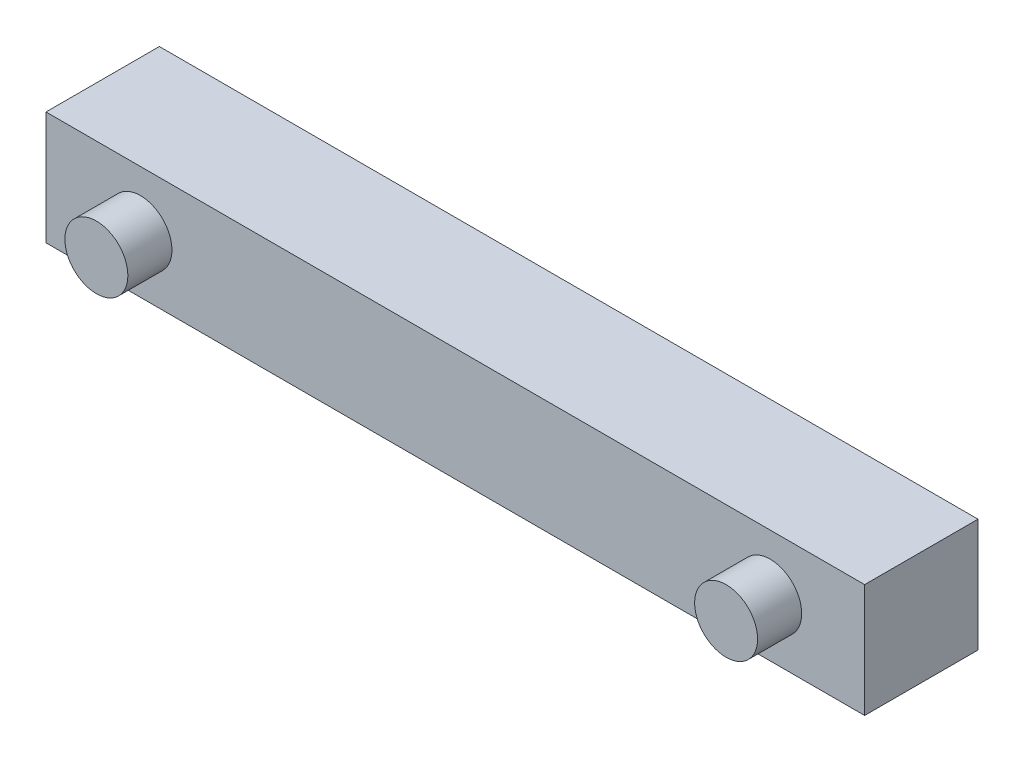
ISO-10303-21;
HEADER;
FILE_DESCRIPTION(('STEP AP214'),'2;1');
FILE_NAME('part.step','',(''),(''),'','','');
FILE_SCHEMA(('AUTOMOTIVE_DESIGN { 1 0 10303 214 1 1 1 1 }'));
ENDSEC;
DATA;
#1=APPLICATION_CONTEXT('core data for automotive mechanical design processes');
#2=APPLICATION_PROTOCOL_DEFINITION('international standard','automotive_design',2000,#1);
#3=PRODUCT_CONTEXT('',#1,'mechanical');
#4=PRODUCT('Part','Part','',(#3));
#5=PRODUCT_RELATED_PRODUCT_CATEGORY('part','',(#4));
#6=PRODUCT_DEFINITION_FORMATION('','',#4);
#7=PRODUCT_DEFINITION_CONTEXT('part definition',#1,'design');
#8=PRODUCT_DEFINITION('design','',#6,#7);
#9=PRODUCT_DEFINITION_SHAPE('','',#8);
#10=(LENGTH_UNIT() NAMED_UNIT(*) SI_UNIT(.MILLI.,.METRE.));
#11=(NAMED_UNIT(*) PLANE_ANGLE_UNIT() SI_UNIT($,.RADIAN.));
#12=(NAMED_UNIT(*) SI_UNIT($,.STERADIAN.) SOLID_ANGLE_UNIT());
#13=UNCERTAINTY_MEASURE_WITH_UNIT(LENGTH_MEASURE(1.E-05),#10,'distance_accuracy_value','');
#14=(GEOMETRIC_REPRESENTATION_CONTEXT(3) GLOBAL_UNCERTAINTY_ASSIGNED_CONTEXT((#13)) GLOBAL_UNIT_ASSIGNED_CONTEXT((#10,
#11,#12)) REPRESENTATION_CONTEXT('',''));
#15=CARTESIAN_POINT('',(0.,0.,0.));
#16=DIRECTION('',(0.,0.,1.));
#17=DIRECTION('',(1.,0.,0.));
#18=AXIS2_PLACEMENT_3D('',#15,#16,#17);
#19=CARTESIAN_POINT('',(0.,0.,9.));
#20=DIRECTION('',(0.,0.,-1.));
#21=DIRECTION('',(-1.,0.,0.));
#22=AXIS2_PLACEMENT_3D('',#19,#20,#21);
#23=PLANE('',#22);
#24=CARTESIAN_POINT('',(7.5,4.5,9.));
#25=DIRECTION('',(0.,0.,-1.));
#26=DIRECTION('',(-1.,0.,0.));
#27=AXIS2_PLACEMENT_3D('',#24,#25,#26);
#28=CIRCLE('',#27,2.5);
#29=CARTESIAN_POINT('',(5.,4.5,9.));
#30=VERTEX_POINT('',#29);
#31=EDGE_CURVE('E42',#30,#30,#28,.F.);
#32=ORIENTED_EDGE('',*,*,#31,.F.);
#33=EDGE_LOOP('',(#32));
#34=FACE_BOUND('',#33,.T.);
#35=DIRECTION('',(0.,-1.,0.));
#36=VECTOR('',#35,1.);
#37=CARTESIAN_POINT('',(0.,0.,9.));
#38=LINE('',#37,#36);
#39=CARTESIAN_POINT('',(0.,9.,9.));
#40=VERTEX_POINT('',#39);
#41=CARTESIAN_POINT('',(0.,0.,9.));
#42=VERTEX_POINT('',#41);
#43=EDGE_CURVE('E86',#40,#42,#38,.T.);
#44=ORIENTED_EDGE('',*,*,#43,.T.);
#45=DIRECTION('',(1.,0.,0.));
#46=VECTOR('',#45,1.);
#47=CARTESIAN_POINT('',(0.,0.,9.));
#48=LINE('',#47,#46);
#49=CARTESIAN_POINT('',(65.,0.,9.));
#50=VERTEX_POINT('',#49);
#51=EDGE_CURVE('E81',#42,#50,#48,.T.);
#52=ORIENTED_EDGE('',*,*,#51,.T.);
#53=DIRECTION('',(0.,1.,0.));
#54=VECTOR('',#53,1.);
#55=CARTESIAN_POINT('',(65.,0.,9.));
#56=LINE('',#55,#54);
#57=CARTESIAN_POINT('',(65.,9.,9.));
#58=VERTEX_POINT('',#57);
#59=EDGE_CURVE('E84',#50,#58,#56,.T.);
#60=ORIENTED_EDGE('',*,*,#59,.T.);
#61=DIRECTION('',(-1.,0.,0.));
#62=VECTOR('',#61,1.);
#63=CARTESIAN_POINT('',(0.,9.,9.));
#64=LINE('',#63,#62);
#65=EDGE_CURVE('E50',#58,#40,#64,.T.);
#66=ORIENTED_EDGE('',*,*,#65,.T.);
#67=EDGE_LOOP('',(#44,#52,#60,#66));
#68=FACE_BOUND('',#67,.T.);
#69=CARTESIAN_POINT('',(57.5,4.5,9.));
#70=DIRECTION('',(0.,0.,-1.));
#71=DIRECTION('',(-1.,0.,0.));
#72=AXIS2_PLACEMENT_3D('',#69,#70,#71);
#73=CIRCLE('',#72,2.5);
#74=CARTESIAN_POINT('',(55.,4.5,9.));
#75=VERTEX_POINT('',#74);
#76=EDGE_CURVE('E11',#75,#75,#73,.F.);
#77=ORIENTED_EDGE('',*,*,#76,.F.);
#78=EDGE_LOOP('',(#77));
#79=FACE_BOUND('',#78,.T.);
#80=ADVANCED_FACE('F33',(#34,#68,#79),#23,.F.);
#81=CARTESIAN_POINT('',(0.,0.,9.));
#82=DIRECTION('',(1.,0.,0.));
#83=DIRECTION('',(0.,0.,-1.));
#84=AXIS2_PLACEMENT_3D('',#81,#82,#83);
#85=PLANE('',#84);
#86=DIRECTION('',(0.,-1.,0.));
#87=VECTOR('',#86,1.);
#88=CARTESIAN_POINT('',(0.,0.,0.));
#89=LINE('',#88,#87);
#90=CARTESIAN_POINT('',(0.,9.,0.));
#91=VERTEX_POINT('',#90);
#92=CARTESIAN_POINT('',(0.,0.,0.));
#93=VERTEX_POINT('',#92);
#94=EDGE_CURVE('E101',#91,#93,#89,.T.);
#95=ORIENTED_EDGE('',*,*,#94,.T.);
#96=DIRECTION('',(0.,0.,-1.));
#97=VECTOR('',#96,1.);
#98=CARTESIAN_POINT('',(0.,0.,9.));
#99=LINE('',#98,#97);
#100=EDGE_CURVE('E92',#42,#93,#99,.T.);
#101=ORIENTED_EDGE('',*,*,#100,.F.);
#102=ORIENTED_EDGE('',*,*,#43,.F.);
#103=DIRECTION('',(0.,0.,-1.));
#104=VECTOR('',#103,1.);
#105=CARTESIAN_POINT('',(0.,9.,9.));
#106=LINE('',#105,#104);
#107=EDGE_CURVE('E97',#40,#91,#106,.T.);
#108=ORIENTED_EDGE('',*,*,#107,.T.);
#109=EDGE_LOOP('',(#95,#101,#102,#108));
#110=FACE_BOUND('',#109,.T.);
#111=ADVANCED_FACE('F35',(#110),#85,.F.);
#112=CARTESIAN_POINT('',(0.,0.,9.));
#113=DIRECTION('',(0.,1.,0.));
#114=DIRECTION('',(0.,0.,1.));
#115=AXIS2_PLACEMENT_3D('',#112,#113,#114);
#116=PLANE('',#115);
#117=DIRECTION('',(1.,0.,0.));
#118=VECTOR('',#117,1.);
#119=CARTESIAN_POINT('',(0.,0.,0.));
#120=LINE('',#119,#118);
#121=CARTESIAN_POINT('',(65.,0.,0.));
#122=VERTEX_POINT('',#121);
#123=EDGE_CURVE('E91',#93,#122,#120,.T.);
#124=ORIENTED_EDGE('',*,*,#123,.T.);
#125=DIRECTION('',(0.,0.,-1.));
#126=VECTOR('',#125,1.);
#127=CARTESIAN_POINT('',(65.,0.,9.));
#128=LINE('',#127,#126);
#129=EDGE_CURVE('E89',#50,#122,#128,.T.);
#130=ORIENTED_EDGE('',*,*,#129,.F.);
#131=ORIENTED_EDGE('',*,*,#51,.F.);
#132=ORIENTED_EDGE('',*,*,#100,.T.);
#133=EDGE_LOOP('',(#124,#130,#131,#132));
#134=FACE_BOUND('',#133,.T.);
#135=ADVANCED_FACE('F90',(#134),#116,.F.);
#136=CARTESIAN_POINT('',(65.,0.,9.));
#137=DIRECTION('',(-1.,0.,0.));
#138=DIRECTION('',(0.,0.,1.));
#139=AXIS2_PLACEMENT_3D('',#136,#137,#138);
#140=PLANE('',#139);
#141=DIRECTION('',(0.,1.,0.));
#142=VECTOR('',#141,1.);
#143=CARTESIAN_POINT('',(65.,0.,0.));
#144=LINE('',#143,#142);
#145=CARTESIAN_POINT('',(65.,9.,0.));
#146=VERTEX_POINT('',#145);
#147=EDGE_CURVE('E67',#122,#146,#144,.T.);
#148=ORIENTED_EDGE('',*,*,#147,.T.);
#149=DIRECTION('',(0.,0.,-1.));
#150=VECTOR('',#149,1.);
#151=CARTESIAN_POINT('',(65.,9.,9.));
#152=LINE('',#151,#150);
#153=EDGE_CURVE('E93',#58,#146,#152,.T.);
#154=ORIENTED_EDGE('',*,*,#153,.F.);
#155=ORIENTED_EDGE('',*,*,#59,.F.);
#156=ORIENTED_EDGE('',*,*,#129,.T.);
#157=EDGE_LOOP('',(#148,#154,#155,#156));
#158=FACE_BOUND('',#157,.T.);
#159=ADVANCED_FACE('F95',(#158),#140,.F.);
#160=CARTESIAN_POINT('',(0.,9.,9.));
#161=DIRECTION('',(0.,-1.,0.));
#162=DIRECTION('',(0.,0.,-1.));
#163=AXIS2_PLACEMENT_3D('',#160,#161,#162);
#164=PLANE('',#163);
#165=DIRECTION('',(-1.,0.,0.));
#166=VECTOR('',#165,1.);
#167=CARTESIAN_POINT('',(0.,9.,0.));
#168=LINE('',#167,#166);
#169=EDGE_CURVE('E73',#146,#91,#168,.T.);
#170=ORIENTED_EDGE('',*,*,#169,.T.);
#171=ORIENTED_EDGE('',*,*,#107,.F.);
#172=ORIENTED_EDGE('',*,*,#65,.F.);
#173=ORIENTED_EDGE('',*,*,#153,.T.);
#174=EDGE_LOOP('',(#170,#171,#172,#173));
#175=FACE_BOUND('',#174,.T.);
#176=ADVANCED_FACE('F127',(#175),#164,.F.);
#177=CARTESIAN_POINT('',(0.,0.,0.));
#178=DIRECTION('',(0.,0.,-1.));
#179=DIRECTION('',(-1.,0.,0.));
#180=AXIS2_PLACEMENT_3D('',#177,#178,#179);
#181=PLANE('',#180);
#182=ORIENTED_EDGE('',*,*,#94,.F.);
#183=ORIENTED_EDGE('',*,*,#169,.F.);
#184=ORIENTED_EDGE('',*,*,#147,.F.);
#185=ORIENTED_EDGE('',*,*,#123,.F.);
#186=EDGE_LOOP('',(#182,#183,#184,#185));
#187=FACE_BOUND('',#186,.T.);
#188=ADVANCED_FACE('F124',(#187),#181,.T.);
#189=CARTESIAN_POINT('',(7.5,4.5,12.5));
#190=DIRECTION('',(0.,0.,-1.));
#191=DIRECTION('',(-1.,0.,0.));
#192=AXIS2_PLACEMENT_3D('',#189,#190,#191);
#193=CYLINDRICAL_SURFACE('',#192,2.5);
#194=CARTESIAN_POINT('',(7.5,4.5,12.5));
#195=DIRECTION('',(0.,0.,1.));
#196=DIRECTION('',(1.,0.,0.));
#197=AXIS2_PLACEMENT_3D('',#194,#195,#196);
#198=CIRCLE('',#197,2.5);
#199=CARTESIAN_POINT('',(10.,4.5,12.5));
#200=VERTEX_POINT('',#199);
#201=EDGE_CURVE('E104',#200,#200,#198,.T.);
#202=ORIENTED_EDGE('',*,*,#201,.F.);
#203=EDGE_LOOP('',(#202));
#204=FACE_BOUND('',#203,.T.);
#205=ORIENTED_EDGE('',*,*,#31,.T.);
#206=EDGE_LOOP('',(#205));
#207=FACE_BOUND('',#206,.T.);
#208=ADVANCED_FACE('F113',(#204,#207),#193,.T.);
#209=CARTESIAN_POINT('',(7.5,4.5,12.5));
#210=DIRECTION('',(0.,0.,1.));
#211=DIRECTION('',(1.,0.,0.));
#212=AXIS2_PLACEMENT_3D('',#209,#210,#211);
#213=PLANE('',#212);
#214=ORIENTED_EDGE('',*,*,#201,.T.);
#215=EDGE_LOOP('',(#214));
#216=FACE_BOUND('',#215,.T.);
#217=ADVANCED_FACE('F155',(#216),#213,.T.);
#218=CARTESIAN_POINT('',(57.5,4.5,12.5));
#219=DIRECTION('',(0.,0.,-1.));
#220=DIRECTION('',(-1.,0.,0.));
#221=AXIS2_PLACEMENT_3D('',#218,#219,#220);
#222=CYLINDRICAL_SURFACE('',#221,2.5);
#223=CARTESIAN_POINT('',(57.5,4.5,12.5));
#224=DIRECTION('',(0.,0.,1.));
#225=DIRECTION('',(1.,0.,0.));
#226=AXIS2_PLACEMENT_3D('',#223,#224,#225);
#227=CIRCLE('',#226,2.5);
#228=CARTESIAN_POINT('',(60.,4.5,12.5));
#229=VERTEX_POINT('',#228);
#230=EDGE_CURVE('E206',#229,#229,#227,.T.);
#231=ORIENTED_EDGE('',*,*,#230,.F.);
#232=EDGE_LOOP('',(#231));
#233=FACE_BOUND('',#232,.T.);
#234=ORIENTED_EDGE('',*,*,#76,.T.);
#235=EDGE_LOOP('',(#234));
#236=FACE_BOUND('',#235,.T.);
#237=ADVANCED_FACE('F162',(#233,#236),#222,.T.);
#238=CARTESIAN_POINT('',(57.5,4.5,12.5));
#239=DIRECTION('',(0.,0.,1.));
#240=DIRECTION('',(1.,0.,0.));
#241=AXIS2_PLACEMENT_3D('',#238,#239,#240);
#242=PLANE('',#241);
#243=ORIENTED_EDGE('',*,*,#230,.T.);
#244=EDGE_LOOP('',(#243));
#245=FACE_BOUND('',#244,.T.);
#246=ADVANCED_FACE('F169',(#245),#242,.T.);
#247=CLOSED_SHELL('',(#80,#111,#135,#159,#176,#188,#208,#217,#237,#246));
#248=MANIFOLD_SOLID_BREP('B2',#247);
#249=ADVANCED_BREP_SHAPE_REPRESENTATION('',(#18,#248),#14);
#250=SHAPE_DEFINITION_REPRESENTATION(#9,#249);
ENDSEC;
END-ISO-10303-21;
